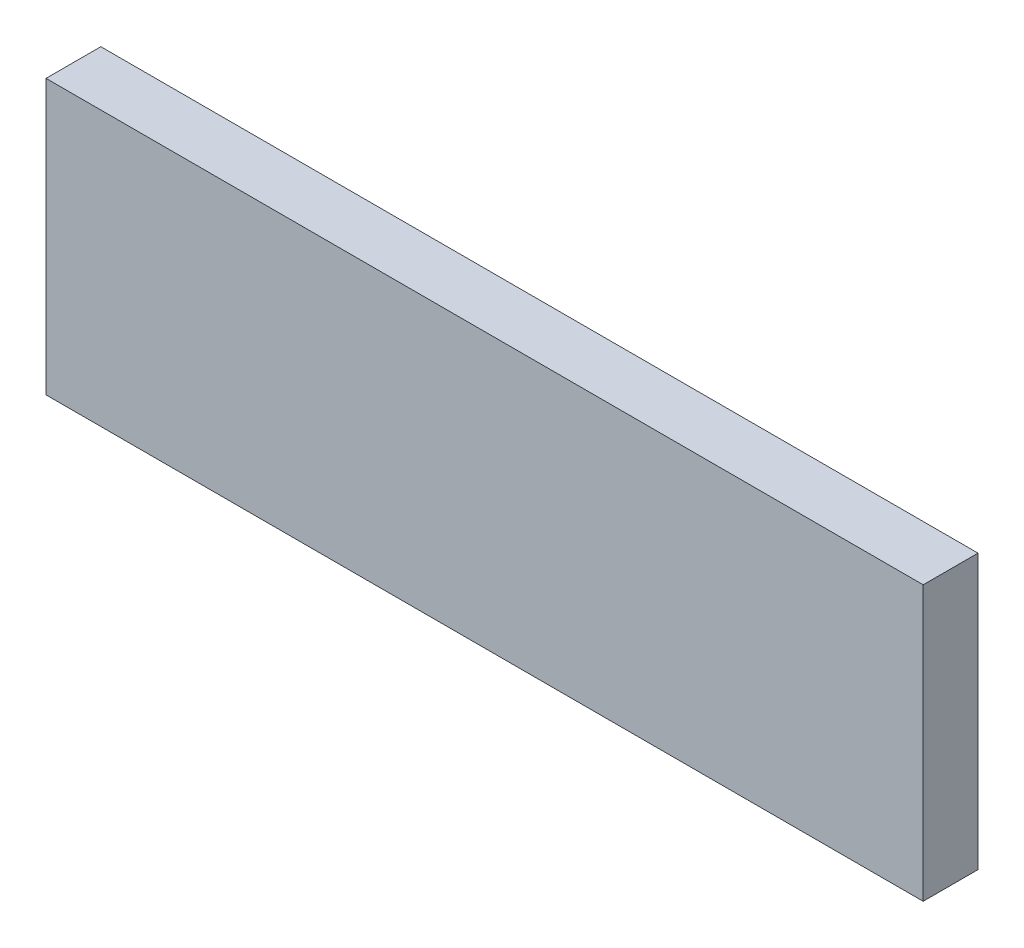
ISO-10303-21;
HEADER;
FILE_DESCRIPTION(('STEP AP214'),'2;1');
FILE_NAME('part.step','',(''),(''),'','','');
FILE_SCHEMA(('AUTOMOTIVE_DESIGN { 1 0 10303 214 1 1 1 1 }'));
ENDSEC;
DATA;
#1=APPLICATION_CONTEXT('core data for automotive mechanical design processes');
#2=APPLICATION_PROTOCOL_DEFINITION('international standard','automotive_design',2000,#1);
#3=PRODUCT_CONTEXT('',#1,'mechanical');
#4=PRODUCT('Part','Part','',(#3));
#5=PRODUCT_RELATED_PRODUCT_CATEGORY('part','',(#4));
#6=PRODUCT_DEFINITION_FORMATION('','',#4);
#7=PRODUCT_DEFINITION_CONTEXT('part definition',#1,'design');
#8=PRODUCT_DEFINITION('design','',#6,#7);
#9=PRODUCT_DEFINITION_SHAPE('','',#8);
#10=(LENGTH_UNIT() NAMED_UNIT(*) SI_UNIT(.MILLI.,.METRE.));
#11=(NAMED_UNIT(*) PLANE_ANGLE_UNIT() SI_UNIT($,.RADIAN.));
#12=(NAMED_UNIT(*) SI_UNIT($,.STERADIAN.) SOLID_ANGLE_UNIT());
#13=UNCERTAINTY_MEASURE_WITH_UNIT(LENGTH_MEASURE(1.E-05),#10,'distance_accuracy_value','');
#14=(GEOMETRIC_REPRESENTATION_CONTEXT(3) GLOBAL_UNCERTAINTY_ASSIGNED_CONTEXT((#13)) GLOBAL_UNIT_ASSIGNED_CONTEXT((#10,
#11,#12)) REPRESENTATION_CONTEXT('',''));
#15=CARTESIAN_POINT('',(0.,0.,0.));
#16=DIRECTION('',(0.,0.,1.));
#17=DIRECTION('',(1.,0.,0.));
#18=AXIS2_PLACEMENT_3D('',#15,#16,#17);
#19=CARTESIAN_POINT('',(-67.7288471053933,6.0541586073501,10.));
#20=DIRECTION('',(1.,0.,0.));
#21=DIRECTION('',(0.,1.,0.));
#22=AXIS2_PLACEMENT_3D('',#19,#20,#21);
#23=PLANE('',#22);
#24=DIRECTION('',(0.,-1.,0.));
#25=VECTOR('',#24,1.);
#26=CARTESIAN_POINT('',(-67.7288471053933,6.0541586073501,0.));
#27=LINE('',#26,#25);
#28=CARTESIAN_POINT('',(-67.7288471053933,6.0541586073501,0.));
#29=VERTEX_POINT('',#28);
#30=CARTESIAN_POINT('',(-67.7288471053933,-43.9458413926499,0.));
#31=VERTEX_POINT('',#30);
#32=EDGE_CURVE('E97',#29,#31,#27,.T.);
#33=ORIENTED_EDGE('',*,*,#32,.T.);
#34=DIRECTION('',(0.,0.,-1.));
#35=VECTOR('',#34,1.);
#36=CARTESIAN_POINT('',(-67.7288471053933,-43.9458413926499,10.));
#37=LINE('',#36,#35);
#38=CARTESIAN_POINT('',(-67.7288471053933,-43.9458413926499,10.));
#39=VERTEX_POINT('',#38);
#40=EDGE_CURVE('E11',#39,#31,#37,.T.);
#41=ORIENTED_EDGE('',*,*,#40,.F.);
#42=DIRECTION('',(0.,-1.,0.));
#43=VECTOR('',#42,1.);
#44=CARTESIAN_POINT('',(-67.7288471053933,6.0541586073501,10.));
#45=LINE('',#44,#43);
#46=CARTESIAN_POINT('',(-67.7288471053933,6.0541586073501,10.));
#47=VERTEX_POINT('',#46);
#48=EDGE_CURVE('E85',#47,#39,#45,.T.);
#49=ORIENTED_EDGE('',*,*,#48,.F.);
#50=DIRECTION('',(0.,0.,-1.));
#51=VECTOR('',#50,1.);
#52=CARTESIAN_POINT('',(-67.7288471053933,6.0541586073501,10.));
#53=LINE('',#52,#51);
#54=EDGE_CURVE('E93',#47,#29,#53,.T.);
#55=ORIENTED_EDGE('',*,*,#54,.T.);
#56=EDGE_LOOP('',(#33,#41,#49,#55));
#57=FACE_BOUND('',#56,.T.);
#58=ADVANCED_FACE('F34',(#57),#23,.F.);
#59=CARTESIAN_POINT('',(-67.7288471053933,-43.9458413926499,10.));
#60=DIRECTION('',(0.,1.,0.));
#61=DIRECTION('',(0.,0.,1.));
#62=AXIS2_PLACEMENT_3D('',#59,#60,#61);
#63=PLANE('',#62);
#64=DIRECTION('',(1.,0.,0.));
#65=VECTOR('',#64,1.);
#66=CARTESIAN_POINT('',(-67.7288471053933,-43.9458413926499,0.));
#67=LINE('',#66,#65);
#68=CARTESIAN_POINT('',(92.2711528946067,-43.9458413926499,0.));
#69=VERTEX_POINT('',#68);
#70=EDGE_CURVE('E89',#31,#69,#67,.T.);
#71=ORIENTED_EDGE('',*,*,#70,.T.);
#72=DIRECTION('',(0.,0.,-1.));
#73=VECTOR('',#72,1.);
#74=CARTESIAN_POINT('',(92.2711528946067,-43.9458413926499,10.));
#75=LINE('',#74,#73);
#76=CARTESIAN_POINT('',(92.2711528946067,-43.9458413926499,10.));
#77=VERTEX_POINT('',#76);
#78=EDGE_CURVE('E42',#77,#69,#75,.T.);
#79=ORIENTED_EDGE('',*,*,#78,.F.);
#80=DIRECTION('',(1.,0.,0.));
#81=VECTOR('',#80,1.);
#82=CARTESIAN_POINT('',(-67.7288471053933,-43.9458413926499,10.));
#83=LINE('',#82,#81);
#84=EDGE_CURVE('E80',#39,#77,#83,.T.);
#85=ORIENTED_EDGE('',*,*,#84,.F.);
#86=ORIENTED_EDGE('',*,*,#40,.T.);
#87=EDGE_LOOP('',(#71,#79,#85,#86));
#88=FACE_BOUND('',#87,.T.);
#89=ADVANCED_FACE('F88',(#88),#63,.F.);
#90=CARTESIAN_POINT('',(92.2711528946067,6.0541586073501,10.));
#91=DIRECTION('',(-1.,0.,0.));
#92=DIRECTION('',(0.,-1.,0.));
#93=AXIS2_PLACEMENT_3D('',#90,#91,#92);
#94=PLANE('',#93);
#95=DIRECTION('',(0.,1.,0.));
#96=VECTOR('',#95,1.);
#97=CARTESIAN_POINT('',(92.2711528946067,6.0541586073501,0.));
#98=LINE('',#97,#96);
#99=CARTESIAN_POINT('',(92.2711528946067,6.0541586073501,0.));
#100=VERTEX_POINT('',#99);
#101=EDGE_CURVE('E67',#69,#100,#98,.T.);
#102=ORIENTED_EDGE('',*,*,#101,.T.);
#103=DIRECTION('',(0.,0.,-1.));
#104=VECTOR('',#103,1.);
#105=CARTESIAN_POINT('',(92.2711528946067,6.0541586073501,10.));
#106=LINE('',#105,#104);
#107=CARTESIAN_POINT('',(92.2711528946067,6.0541586073501,10.));
#108=VERTEX_POINT('',#107);
#109=EDGE_CURVE('E90',#108,#100,#106,.T.);
#110=ORIENTED_EDGE('',*,*,#109,.F.);
#111=DIRECTION('',(0.,1.,0.));
#112=VECTOR('',#111,1.);
#113=CARTESIAN_POINT('',(92.2711528946067,6.0541586073501,10.));
#114=LINE('',#113,#112);
#115=EDGE_CURVE('E83',#77,#108,#114,.T.);
#116=ORIENTED_EDGE('',*,*,#115,.F.);
#117=ORIENTED_EDGE('',*,*,#78,.T.);
#118=EDGE_LOOP('',(#102,#110,#116,#117));
#119=FACE_BOUND('',#118,.T.);
#120=ADVANCED_FACE('F91',(#119),#94,.F.);
#121=CARTESIAN_POINT('',(-67.7288471053933,6.0541586073501,10.));
#122=DIRECTION('',(0.,-1.,0.));
#123=DIRECTION('',(0.,0.,-1.));
#124=AXIS2_PLACEMENT_3D('',#121,#122,#123);
#125=PLANE('',#124);
#126=DIRECTION('',(-1.,0.,0.));
#127=VECTOR('',#126,1.);
#128=CARTESIAN_POINT('',(-67.7288471053933,6.0541586073501,0.));
#129=LINE('',#128,#127);
#130=EDGE_CURVE('E73',#100,#29,#129,.T.);
#131=ORIENTED_EDGE('',*,*,#130,.T.);
#132=ORIENTED_EDGE('',*,*,#54,.F.);
#133=DIRECTION('',(-1.,0.,0.));
#134=VECTOR('',#133,1.);
#135=CARTESIAN_POINT('',(-67.7288471053933,6.0541586073501,10.));
#136=LINE('',#135,#134);
#137=EDGE_CURVE('E50',#108,#47,#136,.T.);
#138=ORIENTED_EDGE('',*,*,#137,.F.);
#139=ORIENTED_EDGE('',*,*,#109,.T.);
#140=EDGE_LOOP('',(#131,#132,#138,#139));
#141=FACE_BOUND('',#140,.T.);
#142=ADVANCED_FACE('F104',(#141),#125,.F.);
#143=CARTESIAN_POINT('',(0.,0.,10.));
#144=DIRECTION('',(0.,0.,1.));
#145=DIRECTION('',(1.,0.,0.));
#146=AXIS2_PLACEMENT_3D('',#143,#144,#145);
#147=PLANE('',#146);
#148=ORIENTED_EDGE('',*,*,#48,.T.);
#149=ORIENTED_EDGE('',*,*,#84,.T.);
#150=ORIENTED_EDGE('',*,*,#115,.T.);
#151=ORIENTED_EDGE('',*,*,#137,.T.);
#152=EDGE_LOOP('',(#148,#149,#150,#151));
#153=FACE_BOUND('',#152,.T.);
#154=ADVANCED_FACE('F81',(#153),#147,.T.);
#155=CARTESIAN_POINT('',(0.,0.,0.));
#156=DIRECTION('',(0.,0.,1.));
#157=DIRECTION('',(1.,0.,0.));
#158=AXIS2_PLACEMENT_3D('',#155,#156,#157);
#159=PLANE('',#158);
#160=ORIENTED_EDGE('',*,*,#32,.F.);
#161=ORIENTED_EDGE('',*,*,#130,.F.);
#162=ORIENTED_EDGE('',*,*,#101,.F.);
#163=ORIENTED_EDGE('',*,*,#70,.F.);
#164=EDGE_LOOP('',(#160,#161,#162,#163));
#165=FACE_BOUND('',#164,.T.);
#166=ADVANCED_FACE('F107',(#165),#159,.F.);
#167=CLOSED_SHELL('',(#58,#89,#120,#142,#154,#166));
#168=MANIFOLD_SOLID_BREP('B2',#167);
#169=ADVANCED_BREP_SHAPE_REPRESENTATION('',(#18,#168),#14);
#170=SHAPE_DEFINITION_REPRESENTATION(#9,#169);
ENDSEC;
END-ISO-10303-21;
